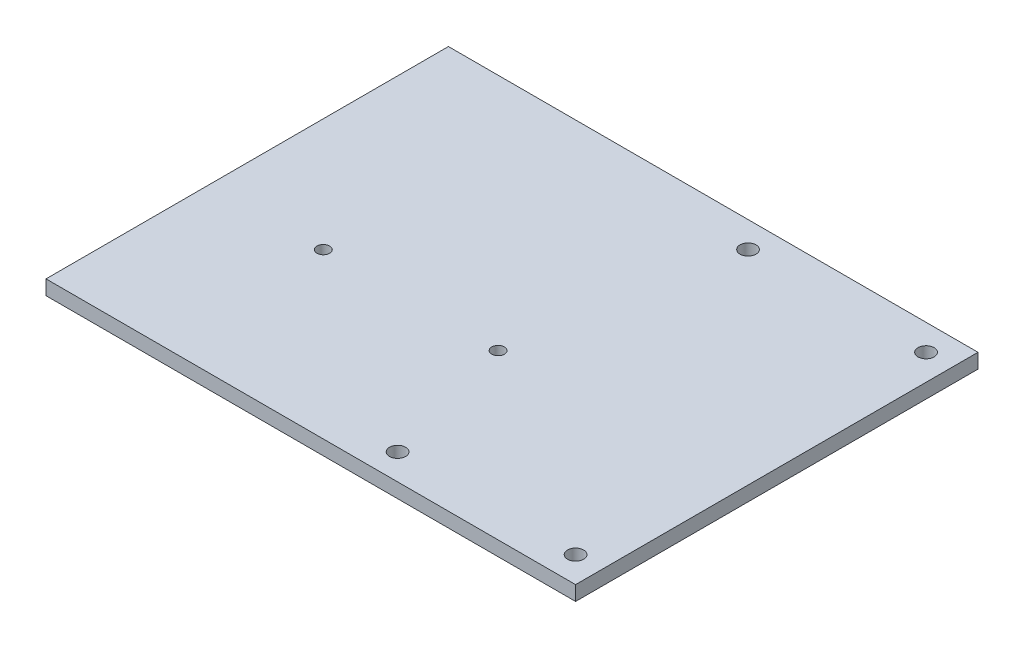
ISO-10303-21;
HEADER;
FILE_DESCRIPTION(('STEP AP214'),'2;1');
FILE_NAME('part.step','',(''),(''),'','','');
FILE_SCHEMA(('AUTOMOTIVE_DESIGN { 1 0 10303 214 1 1 1 1 }'));
ENDSEC;
DATA;
#1=APPLICATION_CONTEXT('core data for automotive mechanical design processes');
#2=APPLICATION_PROTOCOL_DEFINITION('international standard','automotive_design',2000,#1);
#3=PRODUCT_CONTEXT('',#1,'mechanical');
#4=PRODUCT('Part','Part','',(#3));
#5=PRODUCT_RELATED_PRODUCT_CATEGORY('part','',(#4));
#6=PRODUCT_DEFINITION_FORMATION('','',#4);
#7=PRODUCT_DEFINITION_CONTEXT('part definition',#1,'design');
#8=PRODUCT_DEFINITION('design','',#6,#7);
#9=PRODUCT_DEFINITION_SHAPE('','',#8);
#10=(LENGTH_UNIT() NAMED_UNIT(*) SI_UNIT(.MILLI.,.METRE.));
#11=(NAMED_UNIT(*) PLANE_ANGLE_UNIT() SI_UNIT($,.RADIAN.));
#12=(NAMED_UNIT(*) SI_UNIT($,.STERADIAN.) SOLID_ANGLE_UNIT());
#13=UNCERTAINTY_MEASURE_WITH_UNIT(LENGTH_MEASURE(1.E-05),#10,'distance_accuracy_value','');
#14=(GEOMETRIC_REPRESENTATION_CONTEXT(3) GLOBAL_UNCERTAINTY_ASSIGNED_CONTEXT((#13)) GLOBAL_UNIT_ASSIGNED_CONTEXT((#10,
#11,#12)) REPRESENTATION_CONTEXT('',''));
#15=CARTESIAN_POINT('',(0.,0.,0.));
#16=DIRECTION('',(0.,0.,1.));
#17=DIRECTION('',(1.,0.,0.));
#18=AXIS2_PLACEMENT_3D('',#15,#16,#17);
#19=CARTESIAN_POINT('',(0.,6.35,0.));
#20=DIRECTION('',(0.,1.,0.));
#21=DIRECTION('',(0.,0.,1.));
#22=AXIS2_PLACEMENT_3D('',#19,#20,#21);
#23=PLANE('',#22);
#24=CARTESIAN_POINT('',(-105.,6.35,103.7));
#25=DIRECTION('',(0.,1.,0.));
#26=DIRECTION('',(0.,0.,1.));
#27=AXIS2_PLACEMENT_3D('',#24,#25,#26);
#28=CIRCLE('',#27,2.75000000000001);
#29=CARTESIAN_POINT('',(-105.,6.35,106.45));
#30=VERTEX_POINT('',#29);
#31=EDGE_CURVE('E138',#30,#30,#28,.T.);
#32=ORIENTED_EDGE('',*,*,#31,.F.);
#33=EDGE_LOOP('',(#32));
#34=FACE_BOUND('',#33,.T.);
#35=CARTESIAN_POINT('',(-11.3,6.35,11.3));
#36=DIRECTION('',(0.,1.,0.));
#37=DIRECTION('',(0.,0.,1.));
#38=AXIS2_PLACEMENT_3D('',#35,#36,#37);
#39=CIRCLE('',#38,3.5);
#40=CARTESIAN_POINT('',(-11.3,6.35,14.8));
#41=VERTEX_POINT('',#40);
#42=EDGE_CURVE('E126',#41,#41,#39,.T.);
#43=ORIENTED_EDGE('',*,*,#42,.F.);
#44=EDGE_LOOP('',(#43));
#45=FACE_BOUND('',#44,.T.);
#46=CARTESIAN_POINT('',(-88.7,6.35,163.7));
#47=DIRECTION('',(0.,1.,0.));
#48=DIRECTION('',(0.,0.,1.));
#49=AXIS2_PLACEMENT_3D('',#46,#47,#48);
#50=CIRCLE('',#49,3.50000000000001);
#51=CARTESIAN_POINT('',(-88.7,6.35,167.2));
#52=VERTEX_POINT('',#51);
#53=EDGE_CURVE('E105',#52,#52,#50,.T.);
#54=ORIENTED_EDGE('',*,*,#53,.F.);
#55=EDGE_LOOP('',(#54));
#56=FACE_BOUND('',#55,.T.);
#57=DIRECTION('',(0.,0.,1.));
#58=VECTOR('',#57,1.);
#59=CARTESIAN_POINT('',(-230.3,6.35,0.));
#60=LINE('',#59,#58);
#61=CARTESIAN_POINT('',(-230.3,6.35,0.));
#62=VERTEX_POINT('',#61);
#63=CARTESIAN_POINT('',(-230.3,6.35,175.));
#64=VERTEX_POINT('',#63);
#65=EDGE_CURVE('E90',#62,#64,#60,.T.);
#66=ORIENTED_EDGE('',*,*,#65,.T.);
#67=DIRECTION('',(1.,0.,0.));
#68=VECTOR('',#67,1.);
#69=CARTESIAN_POINT('',(-230.3,6.35,175.));
#70=LINE('',#69,#68);
#71=CARTESIAN_POINT('',(0.,6.35,175.));
#72=VERTEX_POINT('',#71);
#73=EDGE_CURVE('E85',#64,#72,#70,.T.);
#74=ORIENTED_EDGE('',*,*,#73,.T.);
#75=DIRECTION('',(0.,0.,-1.));
#76=VECTOR('',#75,1.);
#77=CARTESIAN_POINT('',(0.,6.35,0.));
#78=LINE('',#77,#76);
#79=CARTESIAN_POINT('',(0.,6.35,0.));
#80=VERTEX_POINT('',#79);
#81=EDGE_CURVE('E88',#72,#80,#78,.T.);
#82=ORIENTED_EDGE('',*,*,#81,.T.);
#83=DIRECTION('',(-1.,0.,0.));
#84=VECTOR('',#83,1.);
#85=CARTESIAN_POINT('',(-230.3,6.35,0.));
#86=LINE('',#85,#84);
#87=EDGE_CURVE('E55',#80,#62,#86,.T.);
#88=ORIENTED_EDGE('',*,*,#87,.T.);
#89=EDGE_LOOP('',(#66,#74,#82,#88));
#90=FACE_BOUND('',#89,.T.);
#91=CARTESIAN_POINT('',(-11.3,6.35,163.7));
#92=DIRECTION('',(0.,1.,0.));
#93=DIRECTION('',(0.,0.,1.));
#94=AXIS2_PLACEMENT_3D('',#91,#92,#93);
#95=CIRCLE('',#94,3.5);
#96=CARTESIAN_POINT('',(-11.3,6.35,167.2));
#97=VERTEX_POINT('',#96);
#98=EDGE_CURVE('E120',#97,#97,#95,.T.);
#99=ORIENTED_EDGE('',*,*,#98,.F.);
#100=EDGE_LOOP('',(#99));
#101=FACE_BOUND('',#100,.T.);
#102=CARTESIAN_POINT('',(-88.7,6.35,11.3));
#103=DIRECTION('',(0.,1.,0.));
#104=DIRECTION('',(0.,0.,1.));
#105=AXIS2_PLACEMENT_3D('',#102,#103,#104);
#106=CIRCLE('',#105,3.50000000000001);
#107=CARTESIAN_POINT('',(-88.7,6.35,14.8));
#108=VERTEX_POINT('',#107);
#109=EDGE_CURVE('E132',#108,#108,#106,.T.);
#110=ORIENTED_EDGE('',*,*,#109,.F.);
#111=EDGE_LOOP('',(#110));
#112=FACE_BOUND('',#111,.T.);
#113=CARTESIAN_POINT('',(-181.,6.35,103.7));
#114=DIRECTION('',(0.,1.,0.));
#115=DIRECTION('',(0.,0.,1.));
#116=AXIS2_PLACEMENT_3D('',#113,#114,#115);
#117=CIRCLE('',#116,2.75000000000001);
#118=CARTESIAN_POINT('',(-181.,6.35,106.45));
#119=VERTEX_POINT('',#118);
#120=EDGE_CURVE('E144',#119,#119,#117,.T.);
#121=ORIENTED_EDGE('',*,*,#120,.F.);
#122=EDGE_LOOP('',(#121));
#123=FACE_BOUND('',#122,.T.);
#124=ADVANCED_FACE('F38',(#34,#45,#56,#90,#101,#112,#123),#23,.T.);
#125=CARTESIAN_POINT('',(0.,0.,0.));
#126=DIRECTION('',(0.,1.,0.));
#127=DIRECTION('',(0.,0.,1.));
#128=AXIS2_PLACEMENT_3D('',#125,#126,#127);
#129=PLANE('',#128);
#130=DIRECTION('',(0.,0.,1.));
#131=VECTOR('',#130,1.);
#132=CARTESIAN_POINT('',(-230.3,0.,0.));
#133=LINE('',#132,#131);
#134=CARTESIAN_POINT('',(-230.3,0.,0.));
#135=VERTEX_POINT('',#134);
#136=CARTESIAN_POINT('',(-230.3,0.,175.));
#137=VERTEX_POINT('',#136);
#138=EDGE_CURVE('E102',#135,#137,#133,.T.);
#139=ORIENTED_EDGE('',*,*,#138,.F.);
#140=DIRECTION('',(-1.,0.,0.));
#141=VECTOR('',#140,1.);
#142=CARTESIAN_POINT('',(-230.3,0.,0.));
#143=LINE('',#142,#141);
#144=CARTESIAN_POINT('',(0.,0.,0.));
#145=VERTEX_POINT('',#144);
#146=EDGE_CURVE('E78',#145,#135,#143,.T.);
#147=ORIENTED_EDGE('',*,*,#146,.F.);
#148=DIRECTION('',(0.,0.,-1.));
#149=VECTOR('',#148,1.);
#150=CARTESIAN_POINT('',(0.,0.,0.));
#151=LINE('',#150,#149);
#152=CARTESIAN_POINT('',(0.,0.,175.));
#153=VERTEX_POINT('',#152);
#154=EDGE_CURVE('E72',#153,#145,#151,.T.);
#155=ORIENTED_EDGE('',*,*,#154,.F.);
#156=DIRECTION('',(1.,0.,0.));
#157=VECTOR('',#156,1.);
#158=CARTESIAN_POINT('',(-230.3,0.,175.));
#159=LINE('',#158,#157);
#160=EDGE_CURVE('E94',#137,#153,#159,.T.);
#161=ORIENTED_EDGE('',*,*,#160,.F.);
#162=EDGE_LOOP('',(#139,#147,#155,#161));
#163=FACE_BOUND('',#162,.T.);
#164=CARTESIAN_POINT('',(-88.7,0.,163.7));
#165=DIRECTION('',(0.,1.,0.));
#166=DIRECTION('',(0.,0.,1.));
#167=AXIS2_PLACEMENT_3D('',#164,#165,#166);
#168=CIRCLE('',#167,3.50000000000001);
#169=CARTESIAN_POINT('',(-88.7,0.,167.2));
#170=VERTEX_POINT('',#169);
#171=EDGE_CURVE('E117',#170,#170,#168,.T.);
#172=ORIENTED_EDGE('',*,*,#171,.T.);
#173=EDGE_LOOP('',(#172));
#174=FACE_BOUND('',#173,.T.);
#175=CARTESIAN_POINT('',(-11.3,0.,163.7));
#176=DIRECTION('',(0.,1.,0.));
#177=DIRECTION('',(0.,0.,1.));
#178=AXIS2_PLACEMENT_3D('',#175,#176,#177);
#179=CIRCLE('',#178,3.5);
#180=CARTESIAN_POINT('',(-11.3,0.,167.2));
#181=VERTEX_POINT('',#180);
#182=EDGE_CURVE('E123',#181,#181,#179,.T.);
#183=ORIENTED_EDGE('',*,*,#182,.T.);
#184=EDGE_LOOP('',(#183));
#185=FACE_BOUND('',#184,.T.);
#186=CARTESIAN_POINT('',(-11.3,0.,11.3));
#187=DIRECTION('',(0.,1.,0.));
#188=DIRECTION('',(0.,0.,1.));
#189=AXIS2_PLACEMENT_3D('',#186,#187,#188);
#190=CIRCLE('',#189,3.5);
#191=CARTESIAN_POINT('',(-11.3,0.,14.8));
#192=VERTEX_POINT('',#191);
#193=EDGE_CURVE('E129',#192,#192,#190,.T.);
#194=ORIENTED_EDGE('',*,*,#193,.T.);
#195=EDGE_LOOP('',(#194));
#196=FACE_BOUND('',#195,.T.);
#197=CARTESIAN_POINT('',(-88.7,0.,11.3));
#198=DIRECTION('',(0.,1.,0.));
#199=DIRECTION('',(0.,0.,1.));
#200=AXIS2_PLACEMENT_3D('',#197,#198,#199);
#201=CIRCLE('',#200,3.50000000000001);
#202=CARTESIAN_POINT('',(-88.7,0.,14.8));
#203=VERTEX_POINT('',#202);
#204=EDGE_CURVE('E135',#203,#203,#201,.T.);
#205=ORIENTED_EDGE('',*,*,#204,.T.);
#206=EDGE_LOOP('',(#205));
#207=FACE_BOUND('',#206,.T.);
#208=CARTESIAN_POINT('',(-105.,0.,103.7));
#209=DIRECTION('',(0.,1.,0.));
#210=DIRECTION('',(0.,0.,1.));
#211=AXIS2_PLACEMENT_3D('',#208,#209,#210);
#212=CIRCLE('',#211,2.75000000000001);
#213=CARTESIAN_POINT('',(-105.,0.,106.45));
#214=VERTEX_POINT('',#213);
#215=EDGE_CURVE('E141',#214,#214,#212,.T.);
#216=ORIENTED_EDGE('',*,*,#215,.T.);
#217=EDGE_LOOP('',(#216));
#218=FACE_BOUND('',#217,.T.);
#219=CARTESIAN_POINT('',(-181.,0.,103.7));
#220=DIRECTION('',(0.,1.,0.));
#221=DIRECTION('',(0.,0.,1.));
#222=AXIS2_PLACEMENT_3D('',#219,#220,#221);
#223=CIRCLE('',#222,2.75000000000001);
#224=CARTESIAN_POINT('',(-181.,0.,106.45));
#225=VERTEX_POINT('',#224);
#226=EDGE_CURVE('E147',#225,#225,#223,.T.);
#227=ORIENTED_EDGE('',*,*,#226,.T.);
#228=EDGE_LOOP('',(#227));
#229=FACE_BOUND('',#228,.T.);
#230=ADVANCED_FACE('F113',(#163,#174,#185,#196,#207,#218,#229),#129,.F.);
#231=CARTESIAN_POINT('',(-230.3,6.35,0.));
#232=DIRECTION('',(1.,0.,0.));
#233=DIRECTION('',(0.,0.,-1.));
#234=AXIS2_PLACEMENT_3D('',#231,#232,#233);
#235=PLANE('',#234);
#236=ORIENTED_EDGE('',*,*,#138,.T.);
#237=DIRECTION('',(0.,-1.,0.));
#238=VECTOR('',#237,1.);
#239=CARTESIAN_POINT('',(-230.3,6.35,175.));
#240=LINE('',#239,#238);
#241=EDGE_CURVE('E11',#64,#137,#240,.T.);
#242=ORIENTED_EDGE('',*,*,#241,.F.);
#243=ORIENTED_EDGE('',*,*,#65,.F.);
#244=DIRECTION('',(0.,-1.,0.));
#245=VECTOR('',#244,1.);
#246=CARTESIAN_POINT('',(-230.3,6.35,0.));
#247=LINE('',#246,#245);
#248=EDGE_CURVE('E98',#62,#135,#247,.T.);
#249=ORIENTED_EDGE('',*,*,#248,.T.);
#250=EDGE_LOOP('',(#236,#242,#243,#249));
#251=FACE_BOUND('',#250,.T.);
#252=ADVANCED_FACE('F40',(#251),#235,.F.);
#253=CARTESIAN_POINT('',(-230.3,6.35,175.));
#254=DIRECTION('',(0.,0.,-1.));
#255=DIRECTION('',(-1.,0.,0.));
#256=AXIS2_PLACEMENT_3D('',#253,#254,#255);
#257=PLANE('',#256);
#258=ORIENTED_EDGE('',*,*,#160,.T.);
#259=DIRECTION('',(0.,-1.,0.));
#260=VECTOR('',#259,1.);
#261=CARTESIAN_POINT('',(0.,6.35,175.));
#262=LINE('',#261,#260);
#263=EDGE_CURVE('E47',#72,#153,#262,.T.);
#264=ORIENTED_EDGE('',*,*,#263,.F.);
#265=ORIENTED_EDGE('',*,*,#73,.F.);
#266=ORIENTED_EDGE('',*,*,#241,.T.);
#267=EDGE_LOOP('',(#258,#264,#265,#266));
#268=FACE_BOUND('',#267,.T.);
#269=ADVANCED_FACE('F93',(#268),#257,.F.);
#270=CARTESIAN_POINT('',(0.,6.35,0.));
#271=DIRECTION('',(-1.,0.,0.));
#272=DIRECTION('',(0.,0.,1.));
#273=AXIS2_PLACEMENT_3D('',#270,#271,#272);
#274=PLANE('',#273);
#275=ORIENTED_EDGE('',*,*,#154,.T.);
#276=DIRECTION('',(0.,-1.,0.));
#277=VECTOR('',#276,1.);
#278=CARTESIAN_POINT('',(0.,6.35,0.));
#279=LINE('',#278,#277);
#280=EDGE_CURVE('E95',#80,#145,#279,.T.);
#281=ORIENTED_EDGE('',*,*,#280,.F.);
#282=ORIENTED_EDGE('',*,*,#81,.F.);
#283=ORIENTED_EDGE('',*,*,#263,.T.);
#284=EDGE_LOOP('',(#275,#281,#282,#283));
#285=FACE_BOUND('',#284,.T.);
#286=ADVANCED_FACE('F96',(#285),#274,.F.);
#287=CARTESIAN_POINT('',(-230.3,6.35,0.));
#288=DIRECTION('',(0.,0.,1.));
#289=DIRECTION('',(1.,0.,0.));
#290=AXIS2_PLACEMENT_3D('',#287,#288,#289);
#291=PLANE('',#290);
#292=ORIENTED_EDGE('',*,*,#146,.T.);
#293=ORIENTED_EDGE('',*,*,#248,.F.);
#294=ORIENTED_EDGE('',*,*,#87,.F.);
#295=ORIENTED_EDGE('',*,*,#280,.T.);
#296=EDGE_LOOP('',(#292,#293,#294,#295));
#297=FACE_BOUND('',#296,.T.);
#298=ADVANCED_FACE('F110',(#297),#291,.F.);
#299=CARTESIAN_POINT('',(-88.7,6.35,163.7));
#300=DIRECTION('',(0.,-1.,0.));
#301=DIRECTION('',(0.,0.,-1.));
#302=AXIS2_PLACEMENT_3D('',#299,#300,#301);
#303=CYLINDRICAL_SURFACE('',#302,3.50000000000001);
#304=ORIENTED_EDGE('',*,*,#53,.T.);
#305=EDGE_LOOP('',(#304));
#306=FACE_BOUND('',#305,.T.);
#307=ORIENTED_EDGE('',*,*,#171,.F.);
#308=EDGE_LOOP('',(#307));
#309=FACE_BOUND('',#308,.T.);
#310=ADVANCED_FACE('F166',(#306,#309),#303,.F.);
#311=CARTESIAN_POINT('',(-11.3,6.35,163.7));
#312=DIRECTION('',(0.,-1.,0.));
#313=DIRECTION('',(0.,0.,-1.));
#314=AXIS2_PLACEMENT_3D('',#311,#312,#313);
#315=CYLINDRICAL_SURFACE('',#314,3.5);
#316=ORIENTED_EDGE('',*,*,#98,.T.);
#317=EDGE_LOOP('',(#316));
#318=FACE_BOUND('',#317,.T.);
#319=ORIENTED_EDGE('',*,*,#182,.F.);
#320=EDGE_LOOP('',(#319));
#321=FACE_BOUND('',#320,.T.);
#322=ADVANCED_FACE('F220',(#318,#321),#315,.F.);
#323=CARTESIAN_POINT('',(-11.3,6.35,11.3));
#324=DIRECTION('',(0.,-1.,0.));
#325=DIRECTION('',(0.,0.,-1.));
#326=AXIS2_PLACEMENT_3D('',#323,#324,#325);
#327=CYLINDRICAL_SURFACE('',#326,3.5);
#328=ORIENTED_EDGE('',*,*,#42,.T.);
#329=EDGE_LOOP('',(#328));
#330=FACE_BOUND('',#329,.T.);
#331=ORIENTED_EDGE('',*,*,#193,.F.);
#332=EDGE_LOOP('',(#331));
#333=FACE_BOUND('',#332,.T.);
#334=ADVANCED_FACE('F229',(#330,#333),#327,.F.);
#335=CARTESIAN_POINT('',(-88.7,6.35,11.3));
#336=DIRECTION('',(0.,-1.,0.));
#337=DIRECTION('',(0.,0.,-1.));
#338=AXIS2_PLACEMENT_3D('',#335,#336,#337);
#339=CYLINDRICAL_SURFACE('',#338,3.50000000000001);
#340=ORIENTED_EDGE('',*,*,#109,.T.);
#341=EDGE_LOOP('',(#340));
#342=FACE_BOUND('',#341,.T.);
#343=ORIENTED_EDGE('',*,*,#204,.F.);
#344=EDGE_LOOP('',(#343));
#345=FACE_BOUND('',#344,.T.);
#346=ADVANCED_FACE('F238',(#342,#345),#339,.F.);
#347=CARTESIAN_POINT('',(-105.,6.35,103.7));
#348=DIRECTION('',(0.,-1.,0.));
#349=DIRECTION('',(0.,0.,-1.));
#350=AXIS2_PLACEMENT_3D('',#347,#348,#349);
#351=CYLINDRICAL_SURFACE('',#350,2.75000000000001);
#352=ORIENTED_EDGE('',*,*,#31,.T.);
#353=EDGE_LOOP('',(#352));
#354=FACE_BOUND('',#353,.T.);
#355=ORIENTED_EDGE('',*,*,#215,.F.);
#356=EDGE_LOOP('',(#355));
#357=FACE_BOUND('',#356,.T.);
#358=ADVANCED_FACE('F248',(#354,#357),#351,.F.);
#359=CARTESIAN_POINT('',(-181.,6.35,103.7));
#360=DIRECTION('',(0.,-1.,0.));
#361=DIRECTION('',(0.,0.,-1.));
#362=AXIS2_PLACEMENT_3D('',#359,#360,#361);
#363=CYLINDRICAL_SURFACE('',#362,2.75000000000001);
#364=ORIENTED_EDGE('',*,*,#120,.T.);
#365=EDGE_LOOP('',(#364));
#366=FACE_BOUND('',#365,.T.);
#367=ORIENTED_EDGE('',*,*,#226,.F.);
#368=EDGE_LOOP('',(#367));
#369=FACE_BOUND('',#368,.T.);
#370=ADVANCED_FACE('F153',(#366,#369),#363,.F.);
#371=CLOSED_SHELL('',(#124,#230,#252,#269,#286,#298,#310,#322,#334,#346,#358,#370));
#372=MANIFOLD_SOLID_BREP('B2',#371);
#373=ADVANCED_BREP_SHAPE_REPRESENTATION('',(#18,#372),#14);
#374=SHAPE_DEFINITION_REPRESENTATION(#9,#373);
ENDSEC;
END-ISO-10303-21;
